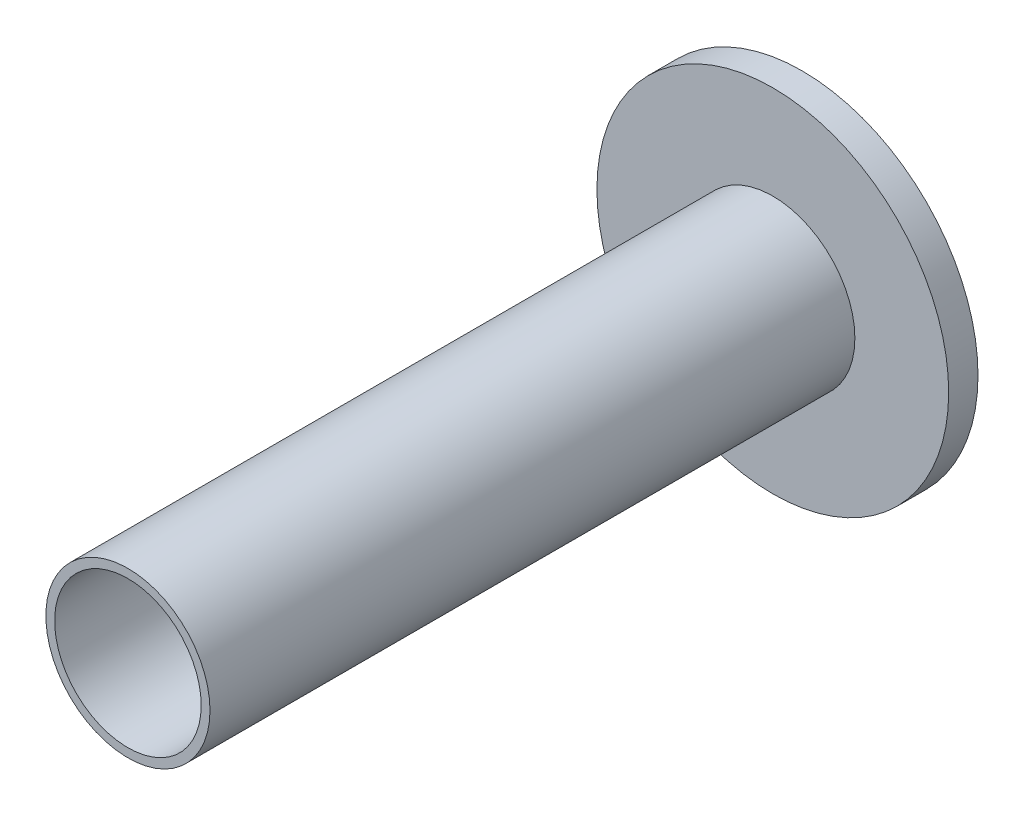
ISO-10303-21;
HEADER;
FILE_DESCRIPTION(('STEP AP214'),'2;1');
FILE_NAME('part.step','',(''),(''),'','','');
FILE_SCHEMA(('AUTOMOTIVE_DESIGN { 1 0 10303 214 1 1 1 1 }'));
ENDSEC;
DATA;
#1=APPLICATION_CONTEXT('core data for automotive mechanical design processes');
#2=APPLICATION_PROTOCOL_DEFINITION('international standard','automotive_design',2000,#1);
#3=PRODUCT_CONTEXT('',#1,'mechanical');
#4=PRODUCT('Part','Part','',(#3));
#5=PRODUCT_RELATED_PRODUCT_CATEGORY('part','',(#4));
#6=PRODUCT_DEFINITION_FORMATION('','',#4);
#7=PRODUCT_DEFINITION_CONTEXT('part definition',#1,'design');
#8=PRODUCT_DEFINITION('design','',#6,#7);
#9=PRODUCT_DEFINITION_SHAPE('','',#8);
#10=(LENGTH_UNIT() NAMED_UNIT(*) SI_UNIT(.MILLI.,.METRE.));
#11=(NAMED_UNIT(*) PLANE_ANGLE_UNIT() SI_UNIT($,.RADIAN.));
#12=(NAMED_UNIT(*) SI_UNIT($,.STERADIAN.) SOLID_ANGLE_UNIT());
#13=UNCERTAINTY_MEASURE_WITH_UNIT(LENGTH_MEASURE(1.E-05),#10,'distance_accuracy_value','');
#14=(GEOMETRIC_REPRESENTATION_CONTEXT(3) GLOBAL_UNCERTAINTY_ASSIGNED_CONTEXT((#13)) GLOBAL_UNIT_ASSIGNED_CONTEXT((#10,
#11,#12)) REPRESENTATION_CONTEXT('',''));
#15=CARTESIAN_POINT('',(0.,0.,0.));
#16=DIRECTION('',(0.,0.,1.));
#17=DIRECTION('',(1.,0.,0.));
#18=AXIS2_PLACEMENT_3D('',#15,#16,#17);
#19=CARTESIAN_POINT('',(0.,0.,1.));
#20=DIRECTION('',(0.,0.,-1.));
#21=DIRECTION('',(-1.,0.,0.));
#22=AXIS2_PLACEMENT_3D('',#19,#20,#21);
#23=CYLINDRICAL_SURFACE('',#22,6.);
#24=CARTESIAN_POINT('',(0.,0.,1.));
#25=DIRECTION('',(0.,0.,1.));
#26=DIRECTION('',(1.,0.,0.));
#27=AXIS2_PLACEMENT_3D('',#24,#25,#26);
#28=CIRCLE('',#27,6.);
#29=CARTESIAN_POINT('',(6.,0.,1.));
#30=VERTEX_POINT('',#29);
#31=EDGE_CURVE('E44',#30,#30,#28,.T.);
#32=ORIENTED_EDGE('',*,*,#31,.F.);
#33=EDGE_LOOP('',(#32));
#34=FACE_BOUND('',#33,.T.);
#35=CARTESIAN_POINT('',(0.,0.,0.));
#36=DIRECTION('',(0.,0.,1.));
#37=DIRECTION('',(1.,0.,0.));
#38=AXIS2_PLACEMENT_3D('',#35,#36,#37);
#39=CIRCLE('',#38,6.);
#40=CARTESIAN_POINT('',(6.,0.,0.));
#41=VERTEX_POINT('',#40);
#42=EDGE_CURVE('E49',#41,#41,#39,.T.);
#43=ORIENTED_EDGE('',*,*,#42,.T.);
#44=EDGE_LOOP('',(#43));
#45=FACE_BOUND('',#44,.T.);
#46=ADVANCED_FACE('F37',(#34,#45),#23,.T.);
#47=CARTESIAN_POINT('',(0.,0.,1.));
#48=DIRECTION('',(0.,0.,1.));
#49=DIRECTION('',(1.,0.,0.));
#50=AXIS2_PLACEMENT_3D('',#47,#48,#49);
#51=PLANE('',#50);
#52=CARTESIAN_POINT('',(0.,0.,1.));
#53=DIRECTION('',(0.,0.,1.));
#54=DIRECTION('',(1.,0.,0.));
#55=AXIS2_PLACEMENT_3D('',#52,#53,#54);
#56=CIRCLE('',#55,2.8);
#57=CARTESIAN_POINT('',(2.8,0.,1.));
#58=VERTEX_POINT('',#57);
#59=EDGE_CURVE('E57',#58,#58,#56,.T.);
#60=ORIENTED_EDGE('',*,*,#59,.F.);
#61=EDGE_LOOP('',(#60));
#62=FACE_BOUND('',#61,.T.);
#63=ORIENTED_EDGE('',*,*,#31,.T.);
#64=EDGE_LOOP('',(#63));
#65=FACE_BOUND('',#64,.T.);
#66=ADVANCED_FACE('F83',(#62,#65),#51,.T.);
#67=CARTESIAN_POINT('',(0.,0.,0.));
#68=DIRECTION('',(0.,0.,1.));
#69=DIRECTION('',(1.,0.,0.));
#70=AXIS2_PLACEMENT_3D('',#67,#68,#69);
#71=PLANE('',#70);
#72=ORIENTED_EDGE('',*,*,#42,.F.);
#73=EDGE_LOOP('',(#72));
#74=FACE_BOUND('',#73,.T.);
#75=ADVANCED_FACE('F74',(#74),#71,.F.);
#76=CARTESIAN_POINT('',(0.,0.,23.));
#77=DIRECTION('',(0.,0.,1.));
#78=DIRECTION('',(1.,0.,0.));
#79=AXIS2_PLACEMENT_3D('',#76,#77,#78);
#80=PLANE('',#79);
#81=CARTESIAN_POINT('',(0.,0.,23.));
#82=DIRECTION('',(0.,0.,1.));
#83=DIRECTION('',(1.,0.,0.));
#84=AXIS2_PLACEMENT_3D('',#81,#82,#83);
#85=CIRCLE('',#84,2.8);
#86=CARTESIAN_POINT('',(2.8,0.,23.));
#87=VERTEX_POINT('',#86);
#88=EDGE_CURVE('E55',#87,#87,#85,.T.);
#89=ORIENTED_EDGE('',*,*,#88,.T.);
#90=EDGE_LOOP('',(#89));
#91=FACE_BOUND('',#90,.T.);
#92=CARTESIAN_POINT('',(0.,0.,23.));
#93=DIRECTION('',(0.,0.,1.));
#94=DIRECTION('',(1.,0.,0.));
#95=AXIS2_PLACEMENT_3D('',#92,#93,#94);
#96=CIRCLE('',#95,2.5);
#97=CARTESIAN_POINT('',(2.5,0.,23.));
#98=VERTEX_POINT('',#97);
#99=EDGE_CURVE('E61',#98,#98,#96,.T.);
#100=ORIENTED_EDGE('',*,*,#99,.F.);
#101=EDGE_LOOP('',(#100));
#102=FACE_BOUND('',#101,.T.);
#103=ADVANCED_FACE('F71',(#91,#102),#80,.T.);
#104=CARTESIAN_POINT('',(0.,0.,23.));
#105=DIRECTION('',(0.,0.,-1.));
#106=DIRECTION('',(-1.,0.,0.));
#107=AXIS2_PLACEMENT_3D('',#104,#105,#106);
#108=CYLINDRICAL_SURFACE('',#107,2.8);
#109=ORIENTED_EDGE('',*,*,#88,.F.);
#110=EDGE_LOOP('',(#109));
#111=FACE_BOUND('',#110,.T.);
#112=ORIENTED_EDGE('',*,*,#59,.T.);
#113=EDGE_LOOP('',(#112));
#114=FACE_BOUND('',#113,.T.);
#115=ADVANCED_FACE('F73',(#111,#114),#108,.T.);
#116=CARTESIAN_POINT('',(0.,0.,23.));
#117=DIRECTION('',(0.,0.,-1.));
#118=DIRECTION('',(-1.,0.,0.));
#119=AXIS2_PLACEMENT_3D('',#116,#117,#118);
#120=CYLINDRICAL_SURFACE('',#119,2.5);
#121=ORIENTED_EDGE('',*,*,#99,.T.);
#122=EDGE_LOOP('',(#121));
#123=FACE_BOUND('',#122,.T.);
#124=CARTESIAN_POINT('',(0.,0.,1.));
#125=DIRECTION('',(0.,0.,1.));
#126=DIRECTION('',(1.,0.,0.));
#127=AXIS2_PLACEMENT_3D('',#124,#125,#126);
#128=CIRCLE('',#127,2.5);
#129=CARTESIAN_POINT('',(2.5,0.,1.));
#130=VERTEX_POINT('',#129);
#131=EDGE_CURVE('E10',#130,#130,#128,.F.);
#132=ORIENTED_EDGE('',*,*,#131,.T.);
#133=EDGE_LOOP('',(#132));
#134=FACE_BOUND('',#133,.T.);
#135=ADVANCED_FACE('F69',(#123,#134),#120,.F.);
#136=ORIENTED_EDGE('',*,*,#131,.F.);
#137=EDGE_LOOP('',(#136));
#138=FACE_BOUND('',#137,.T.);
#139=ADVANCED_FACE('F93',(#138),#51,.T.);
#140=CLOSED_SHELL('',(#46,#66,#75,#103,#115,#135,#139));
#141=MANIFOLD_SOLID_BREP('B2',#140);
#142=ADVANCED_BREP_SHAPE_REPRESENTATION('',(#18,#141),#14);
#143=SHAPE_DEFINITION_REPRESENTATION(#9,#142);
ENDSEC;
END-ISO-10303-21;
